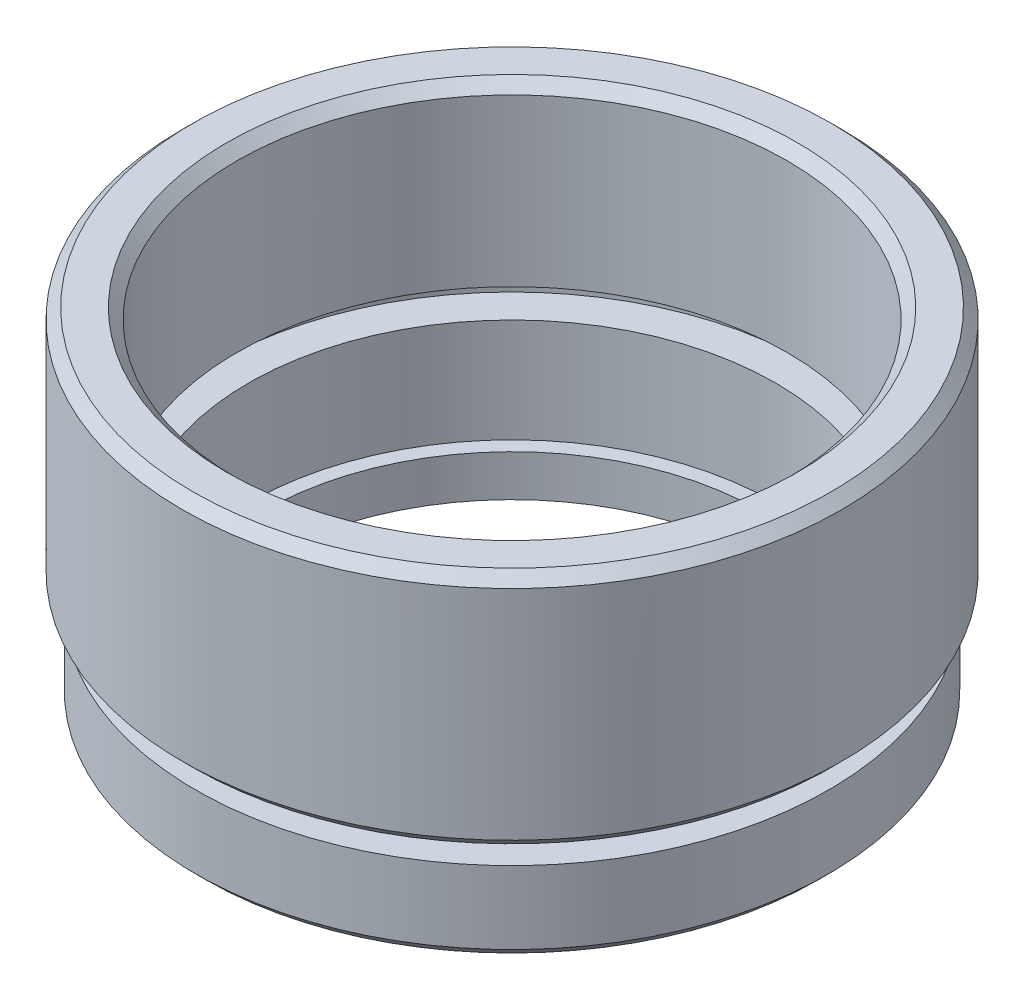
ISO-10303-21;
HEADER;
FILE_DESCRIPTION(('STEP AP214'),'2;1');
FILE_NAME('part.step','',(''),(''),'','','');
FILE_SCHEMA(('AUTOMOTIVE_DESIGN { 1 0 10303 214 1 1 1 1 }'));
ENDSEC;
DATA;
#1=APPLICATION_CONTEXT('core data for automotive mechanical design processes');
#2=APPLICATION_PROTOCOL_DEFINITION('international standard','automotive_design',2000,#1);
#3=PRODUCT_CONTEXT('',#1,'mechanical');
#4=PRODUCT('Part','Part','',(#3));
#5=PRODUCT_RELATED_PRODUCT_CATEGORY('part','',(#4));
#6=PRODUCT_DEFINITION_FORMATION('','',#4);
#7=PRODUCT_DEFINITION_CONTEXT('part definition',#1,'design');
#8=PRODUCT_DEFINITION('design','',#6,#7);
#9=PRODUCT_DEFINITION_SHAPE('','',#8);
#10=(LENGTH_UNIT() NAMED_UNIT(*) SI_UNIT(.MILLI.,.METRE.));
#11=(NAMED_UNIT(*) PLANE_ANGLE_UNIT() SI_UNIT($,.RADIAN.));
#12=(NAMED_UNIT(*) SI_UNIT($,.STERADIAN.) SOLID_ANGLE_UNIT());
#13=UNCERTAINTY_MEASURE_WITH_UNIT(LENGTH_MEASURE(1.E-05),#10,'distance_accuracy_value','');
#14=(GEOMETRIC_REPRESENTATION_CONTEXT(3) GLOBAL_UNCERTAINTY_ASSIGNED_CONTEXT((#13)) GLOBAL_UNIT_ASSIGNED_CONTEXT((#10,
#11,#12)) REPRESENTATION_CONTEXT('',''));
#15=CARTESIAN_POINT('',(0.,0.,0.));
#16=DIRECTION('',(0.,0.,1.));
#17=DIRECTION('',(1.,0.,0.));
#18=AXIS2_PLACEMENT_3D('',#15,#16,#17);
#19=CARTESIAN_POINT('',(0.,0.,0.));
#20=DIRECTION('',(0.,-1.,0.));
#21=DIRECTION('',(0.,0.,-1.));
#22=AXIS2_PLACEMENT_3D('',#19,#20,#21);
#23=CYLINDRICAL_SURFACE('',#22,12.);
#24=CARTESIAN_POINT('',(0.,0.,0.));
#25=DIRECTION('',(0.,-1.,0.));
#26=DIRECTION('',(0.,0.,-1.));
#27=AXIS2_PLACEMENT_3D('',#24,#25,#26);
#28=CIRCLE('',#27,12.);
#29=CARTESIAN_POINT('',(0.,0.,-12.));
#30=VERTEX_POINT('',#29);
#31=EDGE_CURVE('E66',#30,#30,#28,.T.);
#32=ORIENTED_EDGE('',*,*,#31,.T.);
#33=EDGE_LOOP('',(#32));
#34=FACE_BOUND('',#33,.T.);
#35=CARTESIAN_POINT('',(0.,2.,0.));
#36=DIRECTION('',(0.,-1.,0.));
#37=DIRECTION('',(0.,0.,-1.));
#38=AXIS2_PLACEMENT_3D('',#35,#36,#37);
#39=CIRCLE('',#38,12.);
#40=CARTESIAN_POINT('',(0.,2.,-12.));
#41=VERTEX_POINT('',#40);
#42=EDGE_CURVE('E93',#41,#41,#39,.T.);
#43=ORIENTED_EDGE('',*,*,#42,.F.);
#44=EDGE_LOOP('',(#43));
#45=FACE_BOUND('',#44,.T.);
#46=ADVANCED_FACE('F34',(#34,#45),#23,.F.);
#47=CARTESIAN_POINT('',(12.,0.,0.));
#48=DIRECTION('',(0.,-1.,0.));
#49=DIRECTION('',(0.,0.,-1.));
#50=AXIS2_PLACEMENT_3D('',#47,#48,#49);
#51=PLANE('',#50);
#52=CARTESIAN_POINT('',(0.,0.,0.));
#53=DIRECTION('',(0.,-1.,0.));
#54=DIRECTION('',(0.,0.,-1.));
#55=AXIS2_PLACEMENT_3D('',#52,#53,#54);
#56=CIRCLE('',#55,14.75);
#57=CARTESIAN_POINT('',(0.,0.,-14.75));
#58=VERTEX_POINT('',#57);
#59=EDGE_CURVE('E41',#58,#58,#56,.T.);
#60=ORIENTED_EDGE('',*,*,#59,.T.);
#61=EDGE_LOOP('',(#60));
#62=FACE_BOUND('',#61,.T.);
#63=ORIENTED_EDGE('',*,*,#31,.F.);
#64=EDGE_LOOP('',(#63));
#65=FACE_BOUND('',#64,.T.);
#66=ADVANCED_FACE('F101',(#62,#65),#51,.T.);
#67=CARTESIAN_POINT('',(0.,0.,0.));
#68=DIRECTION('',(0.,-1.,0.));
#69=DIRECTION('',(0.,0.,-1.));
#70=AXIS2_PLACEMENT_3D('',#67,#68,#69);
#71=CYLINDRICAL_SURFACE('',#70,15.25);
#72=CARTESIAN_POINT('',(0.,0.499999999999999,0.));
#73=DIRECTION('',(0.,-1.,0.));
#74=DIRECTION('',(0.,0.,-1.));
#75=AXIS2_PLACEMENT_3D('',#72,#73,#74);
#76=CIRCLE('',#75,15.25);
#77=CARTESIAN_POINT('',(0.,0.499999999999999,-15.25));
#78=VERTEX_POINT('',#77);
#79=EDGE_CURVE('E10',#78,#78,#76,.F.);
#80=ORIENTED_EDGE('',*,*,#79,.T.);
#81=EDGE_LOOP('',(#80));
#82=FACE_BOUND('',#81,.T.);
#83=CARTESIAN_POINT('',(0.,4.,0.));
#84=DIRECTION('',(0.,-1.,0.));
#85=DIRECTION('',(0.,0.,-1.));
#86=AXIS2_PLACEMENT_3D('',#83,#84,#85);
#87=CIRCLE('',#86,15.25);
#88=CARTESIAN_POINT('',(0.,4.,-15.25));
#89=VERTEX_POINT('',#88);
#90=EDGE_CURVE('E69',#89,#89,#87,.T.);
#91=ORIENTED_EDGE('',*,*,#90,.T.);
#92=EDGE_LOOP('',(#91));
#93=FACE_BOUND('',#92,.T.);
#94=ADVANCED_FACE('F107',(#82,#93),#71,.T.);
#95=CARTESIAN_POINT('',(15.25,4.,0.));
#96=DIRECTION('',(0.,1.,0.));
#97=DIRECTION('',(0.,0.,1.));
#98=AXIS2_PLACEMENT_3D('',#95,#96,#97);
#99=PLANE('',#98);
#100=CARTESIAN_POINT('',(0.,4.,0.));
#101=DIRECTION('',(0.,-1.,0.));
#102=DIRECTION('',(0.,0.,-1.));
#103=AXIS2_PLACEMENT_3D('',#100,#101,#102);
#104=CIRCLE('',#103,13.75);
#105=CARTESIAN_POINT('',(0.,4.,-13.75));
#106=VERTEX_POINT('',#105);
#107=EDGE_CURVE('E72',#106,#106,#104,.T.);
#108=ORIENTED_EDGE('',*,*,#107,.T.);
#109=EDGE_LOOP('',(#108));
#110=FACE_BOUND('',#109,.T.);
#111=ORIENTED_EDGE('',*,*,#90,.F.);
#112=EDGE_LOOP('',(#111));
#113=FACE_BOUND('',#112,.T.);
#114=ADVANCED_FACE('F139',(#110,#113),#99,.T.);
#115=CARTESIAN_POINT('',(0.,0.,0.));
#116=DIRECTION('',(0.,-1.,0.));
#117=DIRECTION('',(0.,0.,-1.));
#118=AXIS2_PLACEMENT_3D('',#115,#116,#117);
#119=CYLINDRICAL_SURFACE('',#118,13.75);
#120=CARTESIAN_POINT('',(0.,5.,0.));
#121=DIRECTION('',(0.,-1.,0.));
#122=DIRECTION('',(0.,0.,-1.));
#123=AXIS2_PLACEMENT_3D('',#120,#121,#122);
#124=CIRCLE('',#123,13.75);
#125=CARTESIAN_POINT('',(0.,5.,-13.75));
#126=VERTEX_POINT('',#125);
#127=EDGE_CURVE('E75',#126,#126,#124,.T.);
#128=ORIENTED_EDGE('',*,*,#127,.T.);
#129=EDGE_LOOP('',(#128));
#130=FACE_BOUND('',#129,.T.);
#131=ORIENTED_EDGE('',*,*,#107,.F.);
#132=EDGE_LOOP('',(#131));
#133=FACE_BOUND('',#132,.T.);
#134=ADVANCED_FACE('F133',(#130,#133),#119,.T.);
#135=CARTESIAN_POINT('',(13.75,5.,0.));
#136=DIRECTION('',(0.,-1.,0.));
#137=DIRECTION('',(0.,0.,-1.));
#138=AXIS2_PLACEMENT_3D('',#135,#136,#137);
#139=PLANE('',#138);
#140=CARTESIAN_POINT('',(0.,5.,0.));
#141=DIRECTION('',(0.,-1.,0.));
#142=DIRECTION('',(0.,0.,-1.));
#143=AXIS2_PLACEMENT_3D('',#140,#141,#142);
#144=CIRCLE('',#143,15.375);
#145=CARTESIAN_POINT('',(0.,5.,-15.375));
#146=VERTEX_POINT('',#145);
#147=EDGE_CURVE('E45',#146,#146,#144,.T.);
#148=ORIENTED_EDGE('',*,*,#147,.T.);
#149=EDGE_LOOP('',(#148));
#150=FACE_BOUND('',#149,.T.);
#151=ORIENTED_EDGE('',*,*,#127,.F.);
#152=EDGE_LOOP('',(#151));
#153=FACE_BOUND('',#152,.T.);
#154=ADVANCED_FACE('F129',(#150,#153),#139,.T.);
#155=CARTESIAN_POINT('',(0.,0.,0.));
#156=DIRECTION('',(0.,-1.,0.));
#157=DIRECTION('',(0.,0.,-1.));
#158=AXIS2_PLACEMENT_3D('',#155,#156,#157);
#159=CYLINDRICAL_SURFACE('',#158,15.875);
#160=CARTESIAN_POINT('',(0.,16.,0.));
#161=DIRECTION('',(0.,1.,0.));
#162=DIRECTION('',(0.,0.,1.));
#163=AXIS2_PLACEMENT_3D('',#160,#161,#162);
#164=CIRCLE('',#163,15.875);
#165=CARTESIAN_POINT('',(0.,16.,15.875));
#166=VERTEX_POINT('',#165);
#167=EDGE_CURVE('E49',#166,#166,#164,.F.);
#168=ORIENTED_EDGE('',*,*,#167,.T.);
#169=EDGE_LOOP('',(#168));
#170=FACE_BOUND('',#169,.T.);
#171=CARTESIAN_POINT('',(0.,5.5,0.));
#172=DIRECTION('',(0.,-1.,0.));
#173=DIRECTION('',(0.,0.,-1.));
#174=AXIS2_PLACEMENT_3D('',#171,#172,#173);
#175=CIRCLE('',#174,15.875);
#176=CARTESIAN_POINT('',(0.,5.5,-15.875));
#177=VERTEX_POINT('',#176);
#178=EDGE_CURVE('E54',#177,#177,#175,.F.);
#179=ORIENTED_EDGE('',*,*,#178,.T.);
#180=EDGE_LOOP('',(#179));
#181=FACE_BOUND('',#180,.T.);
#182=ADVANCED_FACE('F132',(#170,#181),#159,.T.);
#183=CARTESIAN_POINT('',(15.875,16.5,0.));
#184=DIRECTION('',(0.,1.,0.));
#185=DIRECTION('',(0.,0.,1.));
#186=AXIS2_PLACEMENT_3D('',#183,#184,#185);
#187=PLANE('',#186);
#188=CARTESIAN_POINT('',(0.,16.5,0.));
#189=DIRECTION('',(0.,1.,0.));
#190=DIRECTION('',(0.,0.,1.));
#191=AXIS2_PLACEMENT_3D('',#188,#189,#190);
#192=CIRCLE('',#191,13.75);
#193=CARTESIAN_POINT('',(0.,16.5,13.75));
#194=VERTEX_POINT('',#193);
#195=EDGE_CURVE('E60',#194,#194,#192,.F.);
#196=ORIENTED_EDGE('',*,*,#195,.T.);
#197=EDGE_LOOP('',(#196));
#198=FACE_BOUND('',#197,.T.);
#199=CARTESIAN_POINT('',(0.,16.5,0.));
#200=DIRECTION('',(0.,1.,0.));
#201=DIRECTION('',(0.,0.,1.));
#202=AXIS2_PLACEMENT_3D('',#199,#200,#201);
#203=CIRCLE('',#202,15.375);
#204=CARTESIAN_POINT('',(0.,16.5,15.375));
#205=VERTEX_POINT('',#204);
#206=EDGE_CURVE('E63',#205,#205,#203,.T.);
#207=ORIENTED_EDGE('',*,*,#206,.T.);
#208=EDGE_LOOP('',(#207));
#209=FACE_BOUND('',#208,.T.);
#210=ADVANCED_FACE('F154',(#198,#209),#187,.T.);
#211=CARTESIAN_POINT('',(0.,0.,0.));
#212=DIRECTION('',(0.,-1.,0.));
#213=DIRECTION('',(0.,0.,-1.));
#214=AXIS2_PLACEMENT_3D('',#211,#212,#213);
#215=CYLINDRICAL_SURFACE('',#214,13.25);
#216=CARTESIAN_POINT('',(0.,16.,0.));
#217=DIRECTION('',(0.,1.,0.));
#218=DIRECTION('',(0.,0.,1.));
#219=AXIS2_PLACEMENT_3D('',#216,#217,#218);
#220=CIRCLE('',#219,13.25);
#221=CARTESIAN_POINT('',(0.,16.,13.25));
#222=VERTEX_POINT('',#221);
#223=EDGE_CURVE('E57',#222,#222,#220,.T.);
#224=ORIENTED_EDGE('',*,*,#223,.T.);
#225=EDGE_LOOP('',(#224));
#226=FACE_BOUND('',#225,.T.);
#227=CARTESIAN_POINT('',(0.,8.,0.));
#228=DIRECTION('',(0.,-1.,0.));
#229=DIRECTION('',(0.,0.,-1.));
#230=AXIS2_PLACEMENT_3D('',#227,#228,#229);
#231=CIRCLE('',#230,13.25);
#232=CARTESIAN_POINT('',(0.,8.,-13.25));
#233=VERTEX_POINT('',#232);
#234=EDGE_CURVE('E78',#233,#233,#231,.T.);
#235=ORIENTED_EDGE('',*,*,#234,.T.);
#236=EDGE_LOOP('',(#235));
#237=FACE_BOUND('',#236,.T.);
#238=ADVANCED_FACE('F158',(#226,#237),#215,.F.);
#239=CARTESIAN_POINT('',(13.25,8.,0.));
#240=DIRECTION('',(0.,-1.,0.));
#241=DIRECTION('',(0.,0.,-1.));
#242=AXIS2_PLACEMENT_3D('',#239,#240,#241);
#243=PLANE('',#242);
#244=CARTESIAN_POINT('',(0.,8.,0.));
#245=DIRECTION('',(0.,-1.,0.));
#246=DIRECTION('',(0.,0.,-1.));
#247=AXIS2_PLACEMENT_3D('',#244,#245,#246);
#248=CIRCLE('',#247,14.35);
#249=CARTESIAN_POINT('',(0.,8.,-14.35));
#250=VERTEX_POINT('',#249);
#251=EDGE_CURVE('E81',#250,#250,#248,.T.);
#252=ORIENTED_EDGE('',*,*,#251,.T.);
#253=EDGE_LOOP('',(#252));
#254=FACE_BOUND('',#253,.T.);
#255=ORIENTED_EDGE('',*,*,#234,.F.);
#256=EDGE_LOOP('',(#255));
#257=FACE_BOUND('',#256,.T.);
#258=ADVANCED_FACE('F162',(#254,#257),#243,.T.);
#259=CARTESIAN_POINT('',(0.,0.,0.));
#260=DIRECTION('',(0.,-1.,0.));
#261=DIRECTION('',(0.,0.,-1.));
#262=AXIS2_PLACEMENT_3D('',#259,#260,#261);
#263=CYLINDRICAL_SURFACE('',#262,14.35);
#264=CARTESIAN_POINT('',(0.,7.,0.));
#265=DIRECTION('',(0.,-1.,0.));
#266=DIRECTION('',(0.,0.,-1.));
#267=AXIS2_PLACEMENT_3D('',#264,#265,#266);
#268=CIRCLE('',#267,14.35);
#269=CARTESIAN_POINT('',(0.,7.,-14.35));
#270=VERTEX_POINT('',#269);
#271=EDGE_CURVE('E84',#270,#270,#268,.T.);
#272=ORIENTED_EDGE('',*,*,#271,.T.);
#273=EDGE_LOOP('',(#272));
#274=FACE_BOUND('',#273,.T.);
#275=ORIENTED_EDGE('',*,*,#251,.F.);
#276=EDGE_LOOP('',(#275));
#277=FACE_BOUND('',#276,.T.);
#278=ADVANCED_FACE('F166',(#274,#277),#263,.F.);
#279=CARTESIAN_POINT('',(14.35,7.,0.));
#280=DIRECTION('',(0.,1.,0.));
#281=DIRECTION('',(0.,0.,1.));
#282=AXIS2_PLACEMENT_3D('',#279,#280,#281);
#283=PLANE('',#282);
#284=CARTESIAN_POINT('',(0.,7.,0.));
#285=DIRECTION('',(0.,-1.,0.));
#286=DIRECTION('',(0.,0.,-1.));
#287=AXIS2_PLACEMENT_3D('',#284,#285,#286);
#288=CIRCLE('',#287,12.7);
#289=CARTESIAN_POINT('',(0.,7.,-12.7));
#290=VERTEX_POINT('',#289);
#291=EDGE_CURVE('E87',#290,#290,#288,.T.);
#292=ORIENTED_EDGE('',*,*,#291,.T.);
#293=EDGE_LOOP('',(#292));
#294=FACE_BOUND('',#293,.T.);
#295=ORIENTED_EDGE('',*,*,#271,.F.);
#296=EDGE_LOOP('',(#295));
#297=FACE_BOUND('',#296,.T.);
#298=ADVANCED_FACE('F170',(#294,#297),#283,.T.);
#299=CARTESIAN_POINT('',(0.,0.,0.));
#300=DIRECTION('',(0.,-1.,0.));
#301=DIRECTION('',(0.,0.,-1.));
#302=AXIS2_PLACEMENT_3D('',#299,#300,#301);
#303=CYLINDRICAL_SURFACE('',#302,12.7);
#304=CARTESIAN_POINT('',(0.,2.,0.));
#305=DIRECTION('',(0.,-1.,0.));
#306=DIRECTION('',(0.,0.,-1.));
#307=AXIS2_PLACEMENT_3D('',#304,#305,#306);
#308=CIRCLE('',#307,12.7);
#309=CARTESIAN_POINT('',(0.,2.,-12.7));
#310=VERTEX_POINT('',#309);
#311=EDGE_CURVE('E90',#310,#310,#308,.T.);
#312=ORIENTED_EDGE('',*,*,#311,.T.);
#313=EDGE_LOOP('',(#312));
#314=FACE_BOUND('',#313,.T.);
#315=ORIENTED_EDGE('',*,*,#291,.F.);
#316=EDGE_LOOP('',(#315));
#317=FACE_BOUND('',#316,.T.);
#318=ADVANCED_FACE('F174',(#314,#317),#303,.F.);
#319=CARTESIAN_POINT('',(12.7,2.,0.));
#320=DIRECTION('',(0.,1.,0.));
#321=DIRECTION('',(0.,0.,1.));
#322=AXIS2_PLACEMENT_3D('',#319,#320,#321);
#323=PLANE('',#322);
#324=ORIENTED_EDGE('',*,*,#42,.T.);
#325=EDGE_LOOP('',(#324));
#326=FACE_BOUND('',#325,.T.);
#327=ORIENTED_EDGE('',*,*,#311,.F.);
#328=EDGE_LOOP('',(#327));
#329=FACE_BOUND('',#328,.T.);
#330=ADVANCED_FACE('F97',(#326,#329),#323,.T.);
#331=CARTESIAN_POINT('',(0.,16.5,0.));
#332=DIRECTION('',(0.,1.,0.));
#333=DIRECTION('',(0.,0.,1.));
#334=AXIS2_PLACEMENT_3D('',#331,#332,#333);
#335=CONICAL_SURFACE('',#334,13.75,0.785398163397448);
#336=ORIENTED_EDGE('',*,*,#223,.F.);
#337=EDGE_LOOP('',(#336));
#338=FACE_BOUND('',#337,.T.);
#339=ORIENTED_EDGE('',*,*,#195,.F.);
#340=EDGE_LOOP('',(#339));
#341=FACE_BOUND('',#340,.T.);
#342=ADVANCED_FACE('F111',(#338,#341),#335,.F.);
#343=CARTESIAN_POINT('',(0.,16.,0.));
#344=DIRECTION('',(0.,-1.,0.));
#345=DIRECTION('',(0.,0.,-1.));
#346=AXIS2_PLACEMENT_3D('',#343,#344,#345);
#347=CONICAL_SURFACE('',#346,15.875,0.785398163397448);
#348=ORIENTED_EDGE('',*,*,#206,.F.);
#349=EDGE_LOOP('',(#348));
#350=FACE_BOUND('',#349,.T.);
#351=ORIENTED_EDGE('',*,*,#167,.F.);
#352=EDGE_LOOP('',(#351));
#353=FACE_BOUND('',#352,.T.);
#354=ADVANCED_FACE('F114',(#350,#353),#347,.T.);
#355=CARTESIAN_POINT('',(0.,5.,0.));
#356=DIRECTION('',(0.,1.,0.));
#357=DIRECTION('',(0.,0.,1.));
#358=AXIS2_PLACEMENT_3D('',#355,#356,#357);
#359=CONICAL_SURFACE('',#358,15.375,0.785398163397452);
#360=ORIENTED_EDGE('',*,*,#178,.F.);
#361=EDGE_LOOP('',(#360));
#362=FACE_BOUND('',#361,.T.);
#363=ORIENTED_EDGE('',*,*,#147,.F.);
#364=EDGE_LOOP('',(#363));
#365=FACE_BOUND('',#364,.T.);
#366=ADVANCED_FACE('F117',(#362,#365),#359,.T.);
#367=CARTESIAN_POINT('',(0.,0.,0.));
#368=DIRECTION('',(0.,1.,0.));
#369=DIRECTION('',(0.,0.,1.));
#370=AXIS2_PLACEMENT_3D('',#367,#368,#369);
#371=CONICAL_SURFACE('',#370,14.75,0.785398163397443);
#372=ORIENTED_EDGE('',*,*,#79,.F.);
#373=EDGE_LOOP('',(#372));
#374=FACE_BOUND('',#373,.T.);
#375=ORIENTED_EDGE('',*,*,#59,.F.);
#376=EDGE_LOOP('',(#375));
#377=FACE_BOUND('',#376,.T.);
#378=ADVANCED_FACE('F36',(#374,#377),#371,.T.);
#379=CLOSED_SHELL('',(#46,#66,#94,#114,#134,#154,#182,#210,#238,#258,#278,#298,#318,#330,#342,
#354,#366,#378));
#380=MANIFOLD_SOLID_BREP('B2',#379);
#381=ADVANCED_BREP_SHAPE_REPRESENTATION('',(#18,#380),#14);
#382=SHAPE_DEFINITION_REPRESENTATION(#9,#381);
ENDSEC;
END-ISO-10303-21;
